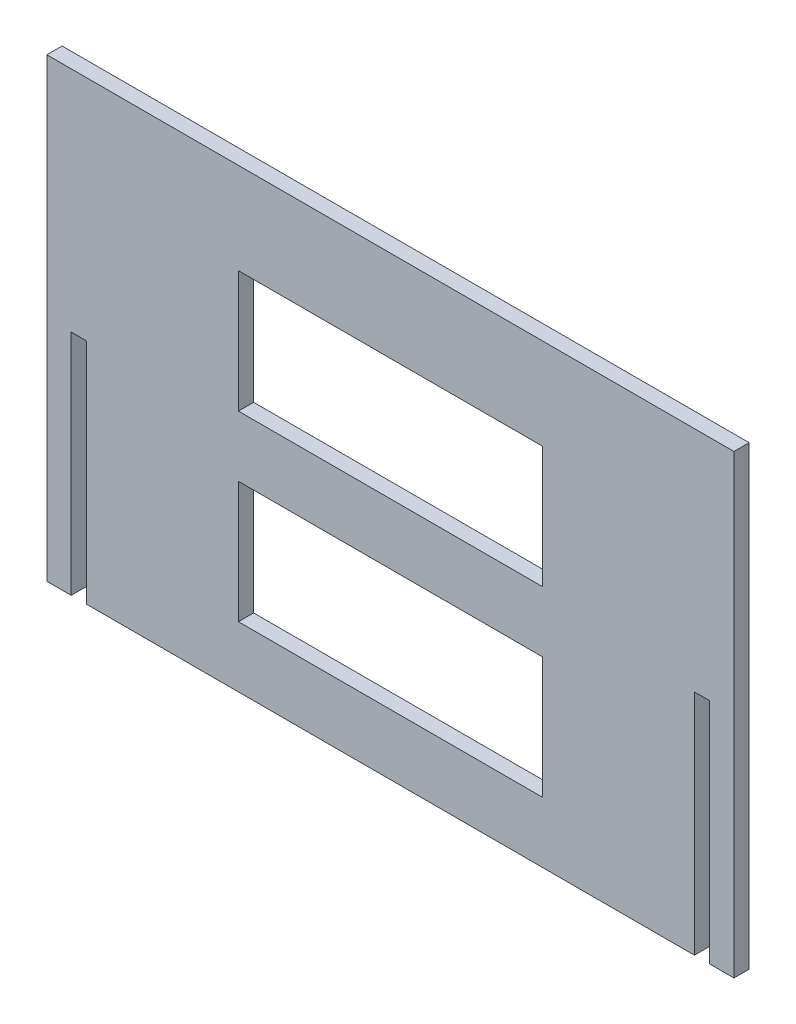
ISO-10303-21;
HEADER;
FILE_DESCRIPTION(('STEP AP214'),'2;1');
FILE_NAME('part.step','',(''),(''),'','','');
FILE_SCHEMA(('AUTOMOTIVE_DESIGN { 1 0 10303 214 1 1 1 1 }'));
ENDSEC;
DATA;
#1=APPLICATION_CONTEXT('core data for automotive mechanical design processes');
#2=APPLICATION_PROTOCOL_DEFINITION('international standard','automotive_design',2000,#1);
#3=PRODUCT_CONTEXT('',#1,'mechanical');
#4=PRODUCT('Part','Part','',(#3));
#5=PRODUCT_RELATED_PRODUCT_CATEGORY('part','',(#4));
#6=PRODUCT_DEFINITION_FORMATION('','',#4);
#7=PRODUCT_DEFINITION_CONTEXT('part definition',#1,'design');
#8=PRODUCT_DEFINITION('design','',#6,#7);
#9=PRODUCT_DEFINITION_SHAPE('','',#8);
#10=(LENGTH_UNIT() NAMED_UNIT(*) SI_UNIT(.MILLI.,.METRE.));
#11=(NAMED_UNIT(*) PLANE_ANGLE_UNIT() SI_UNIT($,.RADIAN.));
#12=(NAMED_UNIT(*) SI_UNIT($,.STERADIAN.) SOLID_ANGLE_UNIT());
#13=UNCERTAINTY_MEASURE_WITH_UNIT(LENGTH_MEASURE(1.E-05),#10,'distance_accuracy_value','');
#14=(GEOMETRIC_REPRESENTATION_CONTEXT(3) GLOBAL_UNCERTAINTY_ASSIGNED_CONTEXT((#13)) GLOBAL_UNIT_ASSIGNED_CONTEXT((#10,
#11,#12)) REPRESENTATION_CONTEXT('',''));
#15=CARTESIAN_POINT('',(0.,0.,0.));
#16=DIRECTION('',(0.,0.,1.));
#17=DIRECTION('',(1.,0.,0.));
#18=AXIS2_PLACEMENT_3D('',#15,#16,#17);
#19=CARTESIAN_POINT('',(0.,0.,5.));
#20=DIRECTION('',(0.,0.,1.));
#21=DIRECTION('',(1.,0.,0.));
#22=AXIS2_PLACEMENT_3D('',#19,#20,#21);
#23=PLANE('',#22);
#24=DIRECTION('',(0.,-1.,0.));
#25=VECTOR('',#24,1.);
#26=CARTESIAN_POINT('',(-8.00000000000002,150.,5.));
#27=LINE('',#26,#25);
#28=CARTESIAN_POINT('',(-8.00000000000002,150.,5.));
#29=VERTEX_POINT('',#28);
#30=CARTESIAN_POINT('',(-8.,0.,5.));
#31=VERTEX_POINT('',#30);
#32=EDGE_CURVE('E237',#29,#31,#27,.T.);
#33=ORIENTED_EDGE('',*,*,#32,.T.);
#34=DIRECTION('',(1.,0.,0.));
#35=VECTOR('',#34,1.);
#36=CARTESIAN_POINT('',(-8.,0.,5.));
#37=LINE('',#36,#35);
#38=CARTESIAN_POINT('',(0.,0.,5.));
#39=VERTEX_POINT('',#38);
#40=EDGE_CURVE('E240',#31,#39,#37,.T.);
#41=ORIENTED_EDGE('',*,*,#40,.T.);
#42=DIRECTION('',(0.,1.,0.));
#43=VECTOR('',#42,1.);
#44=CARTESIAN_POINT('',(0.,0.,5.));
#45=LINE('',#44,#43);
#46=CARTESIAN_POINT('',(0.,75.,5.));
#47=VERTEX_POINT('',#46);
#48=EDGE_CURVE('E243',#39,#47,#45,.T.);
#49=ORIENTED_EDGE('',*,*,#48,.T.);
#50=DIRECTION('',(1.,0.,0.));
#51=VECTOR('',#50,1.);
#52=CARTESIAN_POINT('',(0.,75.,5.));
#53=LINE('',#52,#51);
#54=CARTESIAN_POINT('',(5.,75.,5.));
#55=VERTEX_POINT('',#54);
#56=EDGE_CURVE('E245',#47,#55,#53,.T.);
#57=ORIENTED_EDGE('',*,*,#56,.T.);
#58=DIRECTION('',(0.,-1.,0.));
#59=VECTOR('',#58,1.);
#60=CARTESIAN_POINT('',(5.,75.,5.));
#61=LINE('',#60,#59);
#62=CARTESIAN_POINT('',(5.00000000000002,0.,5.));
#63=VERTEX_POINT('',#62);
#64=EDGE_CURVE('E247',#55,#63,#61,.T.);
#65=ORIENTED_EDGE('',*,*,#64,.T.);
#66=DIRECTION('',(1.,0.,0.));
#67=VECTOR('',#66,1.);
#68=CARTESIAN_POINT('',(5.00000000000002,0.,5.));
#69=LINE('',#68,#67);
#70=CARTESIAN_POINT('',(205.,0.,5.));
#71=VERTEX_POINT('',#70);
#72=EDGE_CURVE('E249',#63,#71,#69,.T.);
#73=ORIENTED_EDGE('',*,*,#72,.T.);
#74=DIRECTION('',(0.,1.,0.));
#75=VECTOR('',#74,1.);
#76=CARTESIAN_POINT('',(205.,0.,5.));
#77=LINE('',#76,#75);
#78=CARTESIAN_POINT('',(205.,75.,5.));
#79=VERTEX_POINT('',#78);
#80=EDGE_CURVE('E251',#71,#79,#77,.T.);
#81=ORIENTED_EDGE('',*,*,#80,.T.);
#82=DIRECTION('',(1.,0.,0.));
#83=VECTOR('',#82,1.);
#84=CARTESIAN_POINT('',(205.,75.,5.));
#85=LINE('',#84,#83);
#86=CARTESIAN_POINT('',(210.,75.,5.));
#87=VERTEX_POINT('',#86);
#88=EDGE_CURVE('E253',#79,#87,#85,.T.);
#89=ORIENTED_EDGE('',*,*,#88,.T.);
#90=DIRECTION('',(0.,-1.,0.));
#91=VECTOR('',#90,1.);
#92=CARTESIAN_POINT('',(210.,75.,5.));
#93=LINE('',#92,#91);
#94=CARTESIAN_POINT('',(210.,0.,5.));
#95=VERTEX_POINT('',#94);
#96=EDGE_CURVE('E255',#87,#95,#93,.T.);
#97=ORIENTED_EDGE('',*,*,#96,.T.);
#98=DIRECTION('',(1.,0.,0.));
#99=VECTOR('',#98,1.);
#100=CARTESIAN_POINT('',(210.,0.,5.));
#101=LINE('',#100,#99);
#102=CARTESIAN_POINT('',(218.,0.,5.));
#103=VERTEX_POINT('',#102);
#104=EDGE_CURVE('E257',#95,#103,#101,.T.);
#105=ORIENTED_EDGE('',*,*,#104,.T.);
#106=DIRECTION('',(0.,1.,0.));
#107=VECTOR('',#106,1.);
#108=CARTESIAN_POINT('',(218.,0.,5.));
#109=LINE('',#108,#107);
#110=CARTESIAN_POINT('',(218.,150.,5.));
#111=VERTEX_POINT('',#110);
#112=EDGE_CURVE('E259',#103,#111,#109,.T.);
#113=ORIENTED_EDGE('',*,*,#112,.T.);
#114=DIRECTION('',(-1.,0.,0.));
#115=VECTOR('',#114,1.);
#116=CARTESIAN_POINT('',(218.,150.,5.));
#117=LINE('',#116,#115);
#118=EDGE_CURVE('E261',#111,#29,#117,.T.);
#119=ORIENTED_EDGE('',*,*,#118,.T.);
#120=EDGE_LOOP('',(#33,#41,#49,#57,#65,#73,#81,#89,#97,#105,#113,#119));
#121=FACE_BOUND('',#120,.T.);
#122=DIRECTION('',(1.,0.,0.));
#123=VECTOR('',#122,1.);
#124=CARTESIAN_POINT('',(55.,20.,5.));
#125=LINE('',#124,#123);
#126=CARTESIAN_POINT('',(55.,20.,5.));
#127=VERTEX_POINT('',#126);
#128=CARTESIAN_POINT('',(155.,20.,5.));
#129=VERTEX_POINT('',#128);
#130=EDGE_CURVE('E208',#127,#129,#125,.T.);
#131=ORIENTED_EDGE('',*,*,#130,.F.);
#132=DIRECTION('',(0.,-1.,0.));
#133=VECTOR('',#132,1.);
#134=CARTESIAN_POINT('',(55.,60.,5.));
#135=LINE('',#134,#133);
#136=CARTESIAN_POINT('',(55.,60.,5.));
#137=VERTEX_POINT('',#136);
#138=EDGE_CURVE('E206',#137,#127,#135,.T.);
#139=ORIENTED_EDGE('',*,*,#138,.F.);
#140=DIRECTION('',(-1.,0.,0.));
#141=VECTOR('',#140,1.);
#142=CARTESIAN_POINT('',(55.,60.,5.));
#143=LINE('',#142,#141);
#144=CARTESIAN_POINT('',(155.,60.,5.));
#145=VERTEX_POINT('',#144);
#146=EDGE_CURVE('E214',#145,#137,#143,.T.);
#147=ORIENTED_EDGE('',*,*,#146,.F.);
#148=DIRECTION('',(0.,1.,0.));
#149=VECTOR('',#148,1.);
#150=CARTESIAN_POINT('',(155.,60.,5.));
#151=LINE('',#150,#149);
#152=EDGE_CURVE('E211',#129,#145,#151,.T.);
#153=ORIENTED_EDGE('',*,*,#152,.F.);
#154=EDGE_LOOP('',(#131,#139,#147,#153));
#155=FACE_BOUND('',#154,.T.);
#156=DIRECTION('',(1.,0.,0.));
#157=VECTOR('',#156,1.);
#158=CARTESIAN_POINT('',(55.0000000000001,80.,5.));
#159=LINE('',#158,#157);
#160=CARTESIAN_POINT('',(55.0000000000001,80.,5.));
#161=VERTEX_POINT('',#160);
#162=CARTESIAN_POINT('',(155.,80.,5.));
#163=VERTEX_POINT('',#162);
#164=EDGE_CURVE('E178',#161,#163,#159,.T.);
#165=ORIENTED_EDGE('',*,*,#164,.F.);
#166=DIRECTION('',(0.,-1.,0.));
#167=VECTOR('',#166,1.);
#168=CARTESIAN_POINT('',(55.,120.,5.));
#169=LINE('',#168,#167);
#170=CARTESIAN_POINT('',(55.,120.,5.));
#171=VERTEX_POINT('',#170);
#172=EDGE_CURVE('E170',#171,#161,#169,.T.);
#173=ORIENTED_EDGE('',*,*,#172,.F.);
#174=DIRECTION('',(-1.,0.,0.));
#175=VECTOR('',#174,1.);
#176=CARTESIAN_POINT('',(55.,120.,5.));
#177=LINE('',#176,#175);
#178=CARTESIAN_POINT('',(155.,120.,5.));
#179=VERTEX_POINT('',#178);
#180=EDGE_CURVE('E192',#179,#171,#177,.T.);
#181=ORIENTED_EDGE('',*,*,#180,.F.);
#182=DIRECTION('',(0.,1.,0.));
#183=VECTOR('',#182,1.);
#184=CARTESIAN_POINT('',(155.,120.,5.));
#185=LINE('',#184,#183);
#186=EDGE_CURVE('E190',#163,#179,#185,.T.);
#187=ORIENTED_EDGE('',*,*,#186,.F.);
#188=EDGE_LOOP('',(#165,#173,#181,#187));
#189=FACE_BOUND('',#188,.T.);
#190=ADVANCED_FACE('F33',(#121,#155,#189),#23,.T.);
#191=CARTESIAN_POINT('',(0.,0.,0.));
#192=DIRECTION('',(0.,0.,1.));
#193=DIRECTION('',(1.,0.,0.));
#194=AXIS2_PLACEMENT_3D('',#191,#192,#193);
#195=PLANE('',#194);
#196=DIRECTION('',(0.,-1.,0.));
#197=VECTOR('',#196,1.);
#198=CARTESIAN_POINT('',(55.,60.,0.));
#199=LINE('',#198,#197);
#200=CARTESIAN_POINT('',(55.,60.,0.));
#201=VERTEX_POINT('',#200);
#202=CARTESIAN_POINT('',(55.,20.,0.));
#203=VERTEX_POINT('',#202);
#204=EDGE_CURVE('E186',#201,#203,#199,.T.);
#205=ORIENTED_EDGE('',*,*,#204,.T.);
#206=DIRECTION('',(1.,0.,0.));
#207=VECTOR('',#206,1.);
#208=CARTESIAN_POINT('',(55.,20.,0.));
#209=LINE('',#208,#207);
#210=CARTESIAN_POINT('',(155.,20.,0.));
#211=VERTEX_POINT('',#210);
#212=EDGE_CURVE('E219',#203,#211,#209,.T.);
#213=ORIENTED_EDGE('',*,*,#212,.T.);
#214=DIRECTION('',(0.,1.,0.));
#215=VECTOR('',#214,1.);
#216=CARTESIAN_POINT('',(155.,60.,0.));
#217=LINE('',#216,#215);
#218=CARTESIAN_POINT('',(155.,60.,0.));
#219=VERTEX_POINT('',#218);
#220=EDGE_CURVE('E222',#211,#219,#217,.T.);
#221=ORIENTED_EDGE('',*,*,#220,.T.);
#222=DIRECTION('',(-1.,0.,0.));
#223=VECTOR('',#222,1.);
#224=CARTESIAN_POINT('',(55.,60.,0.));
#225=LINE('',#224,#223);
#226=EDGE_CURVE('E209',#219,#201,#225,.T.);
#227=ORIENTED_EDGE('',*,*,#226,.T.);
#228=EDGE_LOOP('',(#205,#213,#221,#227));
#229=FACE_BOUND('',#228,.T.);
#230=DIRECTION('',(0.,-1.,0.));
#231=VECTOR('',#230,1.);
#232=CARTESIAN_POINT('',(-8.00000000000002,150.,0.));
#233=LINE('',#232,#231);
#234=CARTESIAN_POINT('',(-8.00000000000002,150.,0.));
#235=VERTEX_POINT('',#234);
#236=CARTESIAN_POINT('',(-8.,0.,0.));
#237=VERTEX_POINT('',#236);
#238=EDGE_CURVE('E236',#235,#237,#233,.T.);
#239=ORIENTED_EDGE('',*,*,#238,.F.);
#240=DIRECTION('',(-1.,0.,0.));
#241=VECTOR('',#240,1.);
#242=CARTESIAN_POINT('',(218.,150.,0.));
#243=LINE('',#242,#241);
#244=CARTESIAN_POINT('',(218.,150.,0.));
#245=VERTEX_POINT('',#244);
#246=EDGE_CURVE('E241',#245,#235,#243,.T.);
#247=ORIENTED_EDGE('',*,*,#246,.F.);
#248=DIRECTION('',(0.,1.,0.));
#249=VECTOR('',#248,1.);
#250=CARTESIAN_POINT('',(218.,0.,0.));
#251=LINE('',#250,#249);
#252=CARTESIAN_POINT('',(218.,0.,0.));
#253=VERTEX_POINT('',#252);
#254=EDGE_CURVE('E284',#253,#245,#251,.T.);
#255=ORIENTED_EDGE('',*,*,#254,.F.);
#256=DIRECTION('',(1.,0.,0.));
#257=VECTOR('',#256,1.);
#258=CARTESIAN_POINT('',(210.,0.,0.));
#259=LINE('',#258,#257);
#260=CARTESIAN_POINT('',(210.,0.,0.));
#261=VERTEX_POINT('',#260);
#262=EDGE_CURVE('E282',#261,#253,#259,.T.);
#263=ORIENTED_EDGE('',*,*,#262,.F.);
#264=DIRECTION('',(0.,-1.,0.));
#265=VECTOR('',#264,1.);
#266=CARTESIAN_POINT('',(210.,75.,0.));
#267=LINE('',#266,#265);
#268=CARTESIAN_POINT('',(210.,75.,0.));
#269=VERTEX_POINT('',#268);
#270=EDGE_CURVE('E280',#269,#261,#267,.T.);
#271=ORIENTED_EDGE('',*,*,#270,.F.);
#272=DIRECTION('',(1.,0.,0.));
#273=VECTOR('',#272,1.);
#274=CARTESIAN_POINT('',(205.,75.,0.));
#275=LINE('',#274,#273);
#276=CARTESIAN_POINT('',(205.,75.,0.));
#277=VERTEX_POINT('',#276);
#278=EDGE_CURVE('E278',#277,#269,#275,.T.);
#279=ORIENTED_EDGE('',*,*,#278,.F.);
#280=DIRECTION('',(0.,1.,0.));
#281=VECTOR('',#280,1.);
#282=CARTESIAN_POINT('',(205.,0.,0.));
#283=LINE('',#282,#281);
#284=CARTESIAN_POINT('',(205.,0.,0.));
#285=VERTEX_POINT('',#284);
#286=EDGE_CURVE('E276',#285,#277,#283,.T.);
#287=ORIENTED_EDGE('',*,*,#286,.F.);
#288=DIRECTION('',(1.,0.,0.));
#289=VECTOR('',#288,1.);
#290=CARTESIAN_POINT('',(5.00000000000002,0.,0.));
#291=LINE('',#290,#289);
#292=CARTESIAN_POINT('',(5.00000000000002,0.,0.));
#293=VERTEX_POINT('',#292);
#294=EDGE_CURVE('E274',#293,#285,#291,.T.);
#295=ORIENTED_EDGE('',*,*,#294,.F.);
#296=DIRECTION('',(0.,-1.,0.));
#297=VECTOR('',#296,1.);
#298=CARTESIAN_POINT('',(5.,75.,0.));
#299=LINE('',#298,#297);
#300=CARTESIAN_POINT('',(5.,75.,0.));
#301=VERTEX_POINT('',#300);
#302=EDGE_CURVE('E272',#301,#293,#299,.T.);
#303=ORIENTED_EDGE('',*,*,#302,.F.);
#304=DIRECTION('',(1.,0.,0.));
#305=VECTOR('',#304,1.);
#306=CARTESIAN_POINT('',(0.,75.,0.));
#307=LINE('',#306,#305);
#308=CARTESIAN_POINT('',(0.,75.,0.));
#309=VERTEX_POINT('',#308);
#310=EDGE_CURVE('E270',#309,#301,#307,.T.);
#311=ORIENTED_EDGE('',*,*,#310,.F.);
#312=DIRECTION('',(0.,1.,0.));
#313=VECTOR('',#312,1.);
#314=CARTESIAN_POINT('',(0.,0.,0.));
#315=LINE('',#314,#313);
#316=CARTESIAN_POINT('',(0.,0.,0.));
#317=VERTEX_POINT('',#316);
#318=EDGE_CURVE('E268',#317,#309,#315,.T.);
#319=ORIENTED_EDGE('',*,*,#318,.F.);
#320=DIRECTION('',(1.,0.,0.));
#321=VECTOR('',#320,1.);
#322=CARTESIAN_POINT('',(-8.,0.,0.));
#323=LINE('',#322,#321);
#324=EDGE_CURVE('E266',#237,#317,#323,.T.);
#325=ORIENTED_EDGE('',*,*,#324,.F.);
#326=EDGE_LOOP('',(#239,#247,#255,#263,#271,#279,#287,#295,#303,#311,#319,#325));
#327=FACE_BOUND('',#326,.T.);
#328=DIRECTION('',(0.,-1.,0.));
#329=VECTOR('',#328,1.);
#330=CARTESIAN_POINT('',(55.,120.,0.));
#331=LINE('',#330,#329);
#332=CARTESIAN_POINT('',(55.,120.,0.));
#333=VERTEX_POINT('',#332);
#334=CARTESIAN_POINT('',(55.0000000000001,80.,0.));
#335=VERTEX_POINT('',#334);
#336=EDGE_CURVE('E56',#333,#335,#331,.T.);
#337=ORIENTED_EDGE('',*,*,#336,.T.);
#338=DIRECTION('',(1.,0.,0.));
#339=VECTOR('',#338,1.);
#340=CARTESIAN_POINT('',(55.0000000000001,80.,0.));
#341=LINE('',#340,#339);
#342=CARTESIAN_POINT('',(155.,80.,0.));
#343=VERTEX_POINT('',#342);
#344=EDGE_CURVE('E185',#335,#343,#341,.T.);
#345=ORIENTED_EDGE('',*,*,#344,.T.);
#346=DIRECTION('',(0.,1.,0.));
#347=VECTOR('',#346,1.);
#348=CARTESIAN_POINT('',(155.,120.,0.));
#349=LINE('',#348,#347);
#350=CARTESIAN_POINT('',(155.,120.,0.));
#351=VERTEX_POINT('',#350);
#352=EDGE_CURVE('E198',#343,#351,#349,.T.);
#353=ORIENTED_EDGE('',*,*,#352,.T.);
#354=DIRECTION('',(-1.,0.,0.));
#355=VECTOR('',#354,1.);
#356=CARTESIAN_POINT('',(55.,120.,0.));
#357=LINE('',#356,#355);
#358=EDGE_CURVE('E179',#351,#333,#357,.T.);
#359=ORIENTED_EDGE('',*,*,#358,.T.);
#360=EDGE_LOOP('',(#337,#345,#353,#359));
#361=FACE_BOUND('',#360,.T.);
#362=ADVANCED_FACE('F326',(#229,#327,#361),#195,.F.);
#363=CARTESIAN_POINT('',(-8.00000000000002,150.,5.));
#364=DIRECTION('',(1.,0.,0.));
#365=DIRECTION('',(0.,1.,0.));
#366=AXIS2_PLACEMENT_3D('',#363,#364,#365);
#367=PLANE('',#366);
#368=ORIENTED_EDGE('',*,*,#238,.T.);
#369=DIRECTION('',(0.,0.,-1.));
#370=VECTOR('',#369,1.);
#371=CARTESIAN_POINT('',(-8.,0.,5.));
#372=LINE('',#371,#370);
#373=EDGE_CURVE('E11',#31,#237,#372,.T.);
#374=ORIENTED_EDGE('',*,*,#373,.F.);
#375=ORIENTED_EDGE('',*,*,#32,.F.);
#376=DIRECTION('',(0.,0.,-1.));
#377=VECTOR('',#376,1.);
#378=CARTESIAN_POINT('',(-8.00000000000002,150.,5.));
#379=LINE('',#378,#377);
#380=EDGE_CURVE('E263',#29,#235,#379,.T.);
#381=ORIENTED_EDGE('',*,*,#380,.T.);
#382=EDGE_LOOP('',(#368,#374,#375,#381));
#383=FACE_BOUND('',#382,.T.);
#384=ADVANCED_FACE('F35',(#383),#367,.F.);
#385=CARTESIAN_POINT('',(-8.,0.,5.));
#386=DIRECTION('',(0.,1.,0.));
#387=DIRECTION('',(0.,0.,1.));
#388=AXIS2_PLACEMENT_3D('',#385,#386,#387);
#389=PLANE('',#388);
#390=ORIENTED_EDGE('',*,*,#324,.T.);
#391=DIRECTION('',(0.,0.,-1.));
#392=VECTOR('',#391,1.);
#393=CARTESIAN_POINT('',(0.,0.,5.));
#394=LINE('',#393,#392);
#395=EDGE_CURVE('E41',#39,#317,#394,.T.);
#396=ORIENTED_EDGE('',*,*,#395,.F.);
#397=ORIENTED_EDGE('',*,*,#40,.F.);
#398=ORIENTED_EDGE('',*,*,#373,.T.);
#399=EDGE_LOOP('',(#390,#396,#397,#398));
#400=FACE_BOUND('',#399,.T.);
#401=ADVANCED_FACE('F344',(#400),#389,.F.);
#402=CARTESIAN_POINT('',(0.,0.,5.));
#403=DIRECTION('',(-1.,0.,0.));
#404=DIRECTION('',(0.,0.,1.));
#405=AXIS2_PLACEMENT_3D('',#402,#403,#404);
#406=PLANE('',#405);
#407=ORIENTED_EDGE('',*,*,#318,.T.);
#408=DIRECTION('',(0.,0.,-1.));
#409=VECTOR('',#408,1.);
#410=CARTESIAN_POINT('',(0.,75.,5.));
#411=LINE('',#410,#409);
#412=EDGE_CURVE('E313',#47,#309,#411,.T.);
#413=ORIENTED_EDGE('',*,*,#412,.F.);
#414=ORIENTED_EDGE('',*,*,#48,.F.);
#415=ORIENTED_EDGE('',*,*,#395,.T.);
#416=EDGE_LOOP('',(#407,#413,#414,#415));
#417=FACE_BOUND('',#416,.T.);
#418=ADVANCED_FACE('F320',(#417),#406,.F.);
#419=CARTESIAN_POINT('',(0.,75.,5.));
#420=DIRECTION('',(0.,1.,0.));
#421=DIRECTION('',(0.,0.,1.));
#422=AXIS2_PLACEMENT_3D('',#419,#420,#421);
#423=PLANE('',#422);
#424=ORIENTED_EDGE('',*,*,#310,.T.);
#425=DIRECTION('',(0.,0.,-1.));
#426=VECTOR('',#425,1.);
#427=CARTESIAN_POINT('',(5.,75.,5.));
#428=LINE('',#427,#426);
#429=EDGE_CURVE('E310',#55,#301,#428,.T.);
#430=ORIENTED_EDGE('',*,*,#429,.F.);
#431=ORIENTED_EDGE('',*,*,#56,.F.);
#432=ORIENTED_EDGE('',*,*,#412,.T.);
#433=EDGE_LOOP('',(#424,#430,#431,#432));
#434=FACE_BOUND('',#433,.T.);
#435=ADVANCED_FACE('F332',(#434),#423,.F.);
#436=CARTESIAN_POINT('',(5.,75.,5.));
#437=DIRECTION('',(1.,0.,0.));
#438=DIRECTION('',(0.,1.,0.));
#439=AXIS2_PLACEMENT_3D('',#436,#437,#438);
#440=PLANE('',#439);
#441=ORIENTED_EDGE('',*,*,#302,.T.);
#442=DIRECTION('',(0.,0.,-1.));
#443=VECTOR('',#442,1.);
#444=CARTESIAN_POINT('',(5.00000000000002,0.,5.));
#445=LINE('',#444,#443);
#446=EDGE_CURVE('E307',#63,#293,#445,.T.);
#447=ORIENTED_EDGE('',*,*,#446,.F.);
#448=ORIENTED_EDGE('',*,*,#64,.F.);
#449=ORIENTED_EDGE('',*,*,#429,.T.);
#450=EDGE_LOOP('',(#441,#447,#448,#449));
#451=FACE_BOUND('',#450,.T.);
#452=ADVANCED_FACE('F336',(#451),#440,.F.);
#453=CARTESIAN_POINT('',(5.00000000000002,0.,5.));
#454=DIRECTION('',(0.,1.,0.));
#455=DIRECTION('',(-1.,0.,0.));
#456=AXIS2_PLACEMENT_3D('',#453,#454,#455);
#457=PLANE('',#456);
#458=ORIENTED_EDGE('',*,*,#294,.T.);
#459=DIRECTION('',(0.,0.,-1.));
#460=VECTOR('',#459,1.);
#461=CARTESIAN_POINT('',(205.,0.,5.));
#462=LINE('',#461,#460);
#463=EDGE_CURVE('E304',#71,#285,#462,.T.);
#464=ORIENTED_EDGE('',*,*,#463,.F.);
#465=ORIENTED_EDGE('',*,*,#72,.F.);
#466=ORIENTED_EDGE('',*,*,#446,.T.);
#467=EDGE_LOOP('',(#458,#464,#465,#466));
#468=FACE_BOUND('',#467,.T.);
#469=ADVANCED_FACE('F377',(#468),#457,.F.);
#470=CARTESIAN_POINT('',(205.,0.,5.));
#471=DIRECTION('',(-1.,0.,0.));
#472=DIRECTION('',(0.,0.,1.));
#473=AXIS2_PLACEMENT_3D('',#470,#471,#472);
#474=PLANE('',#473);
#475=ORIENTED_EDGE('',*,*,#286,.T.);
#476=DIRECTION('',(0.,0.,-1.));
#477=VECTOR('',#476,1.);
#478=CARTESIAN_POINT('',(205.,75.,5.));
#479=LINE('',#478,#477);
#480=EDGE_CURVE('E301',#79,#277,#479,.T.);
#481=ORIENTED_EDGE('',*,*,#480,.F.);
#482=ORIENTED_EDGE('',*,*,#80,.F.);
#483=ORIENTED_EDGE('',*,*,#463,.T.);
#484=EDGE_LOOP('',(#475,#481,#482,#483));
#485=FACE_BOUND('',#484,.T.);
#486=ADVANCED_FACE('F375',(#485),#474,.F.);
#487=CARTESIAN_POINT('',(205.,75.,5.));
#488=DIRECTION('',(0.,1.,0.));
#489=DIRECTION('',(0.,0.,1.));
#490=AXIS2_PLACEMENT_3D('',#487,#488,#489);
#491=PLANE('',#490);
#492=ORIENTED_EDGE('',*,*,#278,.T.);
#493=DIRECTION('',(0.,0.,-1.));
#494=VECTOR('',#493,1.);
#495=CARTESIAN_POINT('',(210.,75.,5.));
#496=LINE('',#495,#494);
#497=EDGE_CURVE('E298',#87,#269,#496,.T.);
#498=ORIENTED_EDGE('',*,*,#497,.F.);
#499=ORIENTED_EDGE('',*,*,#88,.F.);
#500=ORIENTED_EDGE('',*,*,#480,.T.);
#501=EDGE_LOOP('',(#492,#498,#499,#500));
#502=FACE_BOUND('',#501,.T.);
#503=ADVANCED_FACE('F371',(#502),#491,.F.);
#504=CARTESIAN_POINT('',(210.,75.,5.));
#505=DIRECTION('',(1.,0.,0.));
#506=DIRECTION('',(0.,0.,-1.));
#507=AXIS2_PLACEMENT_3D('',#504,#505,#506);
#508=PLANE('',#507);
#509=ORIENTED_EDGE('',*,*,#270,.T.);
#510=DIRECTION('',(0.,0.,-1.));
#511=VECTOR('',#510,1.);
#512=CARTESIAN_POINT('',(210.,0.,5.));
#513=LINE('',#512,#511);
#514=EDGE_CURVE('E295',#95,#261,#513,.T.);
#515=ORIENTED_EDGE('',*,*,#514,.F.);
#516=ORIENTED_EDGE('',*,*,#96,.F.);
#517=ORIENTED_EDGE('',*,*,#497,.T.);
#518=EDGE_LOOP('',(#509,#515,#516,#517));
#519=FACE_BOUND('',#518,.T.);
#520=ADVANCED_FACE('F366',(#519),#508,.F.);
#521=CARTESIAN_POINT('',(210.,0.,5.));
#522=DIRECTION('',(0.,1.,0.));
#523=DIRECTION('',(0.,0.,1.));
#524=AXIS2_PLACEMENT_3D('',#521,#522,#523);
#525=PLANE('',#524);
#526=ORIENTED_EDGE('',*,*,#262,.T.);
#527=DIRECTION('',(0.,0.,-1.));
#528=VECTOR('',#527,1.);
#529=CARTESIAN_POINT('',(218.,0.,5.));
#530=LINE('',#529,#528);
#531=EDGE_CURVE('E292',#103,#253,#530,.T.);
#532=ORIENTED_EDGE('',*,*,#531,.F.);
#533=ORIENTED_EDGE('',*,*,#104,.F.);
#534=ORIENTED_EDGE('',*,*,#514,.T.);
#535=EDGE_LOOP('',(#526,#532,#533,#534));
#536=FACE_BOUND('',#535,.T.);
#537=ADVANCED_FACE('F360',(#536),#525,.F.);
#538=CARTESIAN_POINT('',(218.,0.,5.));
#539=DIRECTION('',(-1.,0.,0.));
#540=DIRECTION('',(0.,0.,1.));
#541=AXIS2_PLACEMENT_3D('',#538,#539,#540);
#542=PLANE('',#541);
#543=ORIENTED_EDGE('',*,*,#254,.T.);
#544=DIRECTION('',(0.,0.,-1.));
#545=VECTOR('',#544,1.);
#546=CARTESIAN_POINT('',(218.,150.,5.));
#547=LINE('',#546,#545);
#548=EDGE_CURVE('E289',#111,#245,#547,.T.);
#549=ORIENTED_EDGE('',*,*,#548,.F.);
#550=ORIENTED_EDGE('',*,*,#112,.F.);
#551=ORIENTED_EDGE('',*,*,#531,.T.);
#552=EDGE_LOOP('',(#543,#549,#550,#551));
#553=FACE_BOUND('',#552,.T.);
#554=ADVANCED_FACE('F356',(#553),#542,.F.);
#555=CARTESIAN_POINT('',(218.,150.,5.));
#556=DIRECTION('',(0.,-1.,0.));
#557=DIRECTION('',(1.,0.,0.));
#558=AXIS2_PLACEMENT_3D('',#555,#556,#557);
#559=PLANE('',#558);
#560=ORIENTED_EDGE('',*,*,#246,.T.);
#561=ORIENTED_EDGE('',*,*,#380,.F.);
#562=ORIENTED_EDGE('',*,*,#118,.F.);
#563=ORIENTED_EDGE('',*,*,#548,.T.);
#564=EDGE_LOOP('',(#560,#561,#562,#563));
#565=FACE_BOUND('',#564,.T.);
#566=ADVANCED_FACE('F351',(#565),#559,.F.);
#567=CARTESIAN_POINT('',(55.,60.,5.));
#568=DIRECTION('',(1.,0.,0.));
#569=DIRECTION('',(0.,1.,0.));
#570=AXIS2_PLACEMENT_3D('',#567,#568,#569);
#571=PLANE('',#570);
#572=ORIENTED_EDGE('',*,*,#204,.F.);
#573=DIRECTION('',(0.,0.,-1.));
#574=VECTOR('',#573,1.);
#575=CARTESIAN_POINT('',(55.,60.,5.));
#576=LINE('',#575,#574);
#577=EDGE_CURVE('E216',#137,#201,#576,.T.);
#578=ORIENTED_EDGE('',*,*,#577,.F.);
#579=ORIENTED_EDGE('',*,*,#138,.T.);
#580=DIRECTION('',(0.,0.,-1.));
#581=VECTOR('',#580,1.);
#582=CARTESIAN_POINT('',(55.,20.,5.));
#583=LINE('',#582,#581);
#584=EDGE_CURVE('E233',#127,#203,#583,.T.);
#585=ORIENTED_EDGE('',*,*,#584,.T.);
#586=EDGE_LOOP('',(#572,#578,#579,#585));
#587=FACE_BOUND('',#586,.T.);
#588=ADVANCED_FACE('F394',(#587),#571,.T.);
#589=CARTESIAN_POINT('',(55.,20.,5.));
#590=DIRECTION('',(0.,1.,0.));
#591=DIRECTION('',(0.,0.,1.));
#592=AXIS2_PLACEMENT_3D('',#589,#590,#591);
#593=PLANE('',#592);
#594=ORIENTED_EDGE('',*,*,#212,.F.);
#595=ORIENTED_EDGE('',*,*,#584,.F.);
#596=ORIENTED_EDGE('',*,*,#130,.T.);
#597=DIRECTION('',(0.,0.,-1.));
#598=VECTOR('',#597,1.);
#599=CARTESIAN_POINT('',(155.,20.,5.));
#600=LINE('',#599,#598);
#601=EDGE_CURVE('E231',#129,#211,#600,.T.);
#602=ORIENTED_EDGE('',*,*,#601,.T.);
#603=EDGE_LOOP('',(#594,#595,#596,#602));
#604=FACE_BOUND('',#603,.T.);
#605=ADVANCED_FACE('F432',(#604),#593,.T.);
#606=CARTESIAN_POINT('',(155.,60.,5.));
#607=DIRECTION('',(-1.,0.,0.));
#608=DIRECTION('',(0.,0.,1.));
#609=AXIS2_PLACEMENT_3D('',#606,#607,#608);
#610=PLANE('',#609);
#611=ORIENTED_EDGE('',*,*,#220,.F.);
#612=ORIENTED_EDGE('',*,*,#601,.F.);
#613=ORIENTED_EDGE('',*,*,#152,.T.);
#614=DIRECTION('',(0.,0.,-1.));
#615=VECTOR('',#614,1.);
#616=CARTESIAN_POINT('',(155.,60.,5.));
#617=LINE('',#616,#615);
#618=EDGE_CURVE('E229',#145,#219,#617,.T.);
#619=ORIENTED_EDGE('',*,*,#618,.T.);
#620=EDGE_LOOP('',(#611,#612,#613,#619));
#621=FACE_BOUND('',#620,.T.);
#622=ADVANCED_FACE('F439',(#621),#610,.T.);
#623=CARTESIAN_POINT('',(55.,60.,5.));
#624=DIRECTION('',(0.,-1.,0.));
#625=DIRECTION('',(1.,0.,0.));
#626=AXIS2_PLACEMENT_3D('',#623,#624,#625);
#627=PLANE('',#626);
#628=ORIENTED_EDGE('',*,*,#226,.F.);
#629=ORIENTED_EDGE('',*,*,#618,.F.);
#630=ORIENTED_EDGE('',*,*,#146,.T.);
#631=ORIENTED_EDGE('',*,*,#577,.T.);
#632=EDGE_LOOP('',(#628,#629,#630,#631));
#633=FACE_BOUND('',#632,.T.);
#634=ADVANCED_FACE('F446',(#633),#627,.T.);
#635=CARTESIAN_POINT('',(55.,120.,5.));
#636=DIRECTION('',(1.,0.,0.));
#637=DIRECTION('',(0.,1.,0.));
#638=AXIS2_PLACEMENT_3D('',#635,#636,#637);
#639=PLANE('',#638);
#640=ORIENTED_EDGE('',*,*,#336,.F.);
#641=DIRECTION('',(0.,0.,-1.));
#642=VECTOR('',#641,1.);
#643=CARTESIAN_POINT('',(55.,120.,5.));
#644=LINE('',#643,#642);
#645=EDGE_CURVE('E174',#171,#333,#644,.T.);
#646=ORIENTED_EDGE('',*,*,#645,.F.);
#647=ORIENTED_EDGE('',*,*,#172,.T.);
#648=DIRECTION('',(0.,0.,-1.));
#649=VECTOR('',#648,1.);
#650=CARTESIAN_POINT('',(55.0000000000001,80.,5.));
#651=LINE('',#650,#649);
#652=EDGE_CURVE('E173',#161,#335,#651,.T.);
#653=ORIENTED_EDGE('',*,*,#652,.T.);
#654=EDGE_LOOP('',(#640,#646,#647,#653));
#655=FACE_BOUND('',#654,.T.);
#656=ADVANCED_FACE('F172',(#655),#639,.T.);
#657=CARTESIAN_POINT('',(55.0000000000001,80.,5.));
#658=DIRECTION('',(0.,1.,0.));
#659=DIRECTION('',(0.,0.,1.));
#660=AXIS2_PLACEMENT_3D('',#657,#658,#659);
#661=PLANE('',#660);
#662=ORIENTED_EDGE('',*,*,#344,.F.);
#663=ORIENTED_EDGE('',*,*,#652,.F.);
#664=ORIENTED_EDGE('',*,*,#164,.T.);
#665=DIRECTION('',(0.,0.,-1.));
#666=VECTOR('',#665,1.);
#667=CARTESIAN_POINT('',(155.,80.,5.));
#668=LINE('',#667,#666);
#669=EDGE_CURVE('E187',#163,#343,#668,.T.);
#670=ORIENTED_EDGE('',*,*,#669,.T.);
#671=EDGE_LOOP('',(#662,#663,#664,#670));
#672=FACE_BOUND('',#671,.T.);
#673=ADVANCED_FACE('F182',(#672),#661,.T.);
#674=CARTESIAN_POINT('',(155.,120.,5.));
#675=DIRECTION('',(-1.,0.,0.));
#676=DIRECTION('',(0.,0.,1.));
#677=AXIS2_PLACEMENT_3D('',#674,#675,#676);
#678=PLANE('',#677);
#679=ORIENTED_EDGE('',*,*,#352,.F.);
#680=ORIENTED_EDGE('',*,*,#669,.F.);
#681=ORIENTED_EDGE('',*,*,#186,.T.);
#682=DIRECTION('',(0.,0.,-1.));
#683=VECTOR('',#682,1.);
#684=CARTESIAN_POINT('',(155.,120.,5.));
#685=LINE('',#684,#683);
#686=EDGE_CURVE('E48',#179,#351,#685,.T.);
#687=ORIENTED_EDGE('',*,*,#686,.T.);
#688=EDGE_LOOP('',(#679,#680,#681,#687));
#689=FACE_BOUND('',#688,.T.);
#690=ADVANCED_FACE('F467',(#689),#678,.T.);
#691=CARTESIAN_POINT('',(55.,120.,5.));
#692=DIRECTION('',(0.,-1.,0.));
#693=DIRECTION('',(0.,0.,-1.));
#694=AXIS2_PLACEMENT_3D('',#691,#692,#693);
#695=PLANE('',#694);
#696=ORIENTED_EDGE('',*,*,#358,.F.);
#697=ORIENTED_EDGE('',*,*,#686,.F.);
#698=ORIENTED_EDGE('',*,*,#180,.T.);
#699=ORIENTED_EDGE('',*,*,#645,.T.);
#700=EDGE_LOOP('',(#696,#697,#698,#699));
#701=FACE_BOUND('',#700,.T.);
#702=ADVANCED_FACE('F474',(#701),#695,.T.);
#703=CLOSED_SHELL('',(#190,#362,#384,#401,#418,#435,#452,#469,#486,#503,#520,#537,#554,#566,
#588,#605,#622,#634,#656,#673,#690,#702));
#704=MANIFOLD_SOLID_BREP('B2',#703);
#705=ADVANCED_BREP_SHAPE_REPRESENTATION('',(#18,#704),#14);
#706=SHAPE_DEFINITION_REPRESENTATION(#9,#705);
ENDSEC;
END-ISO-10303-21;
